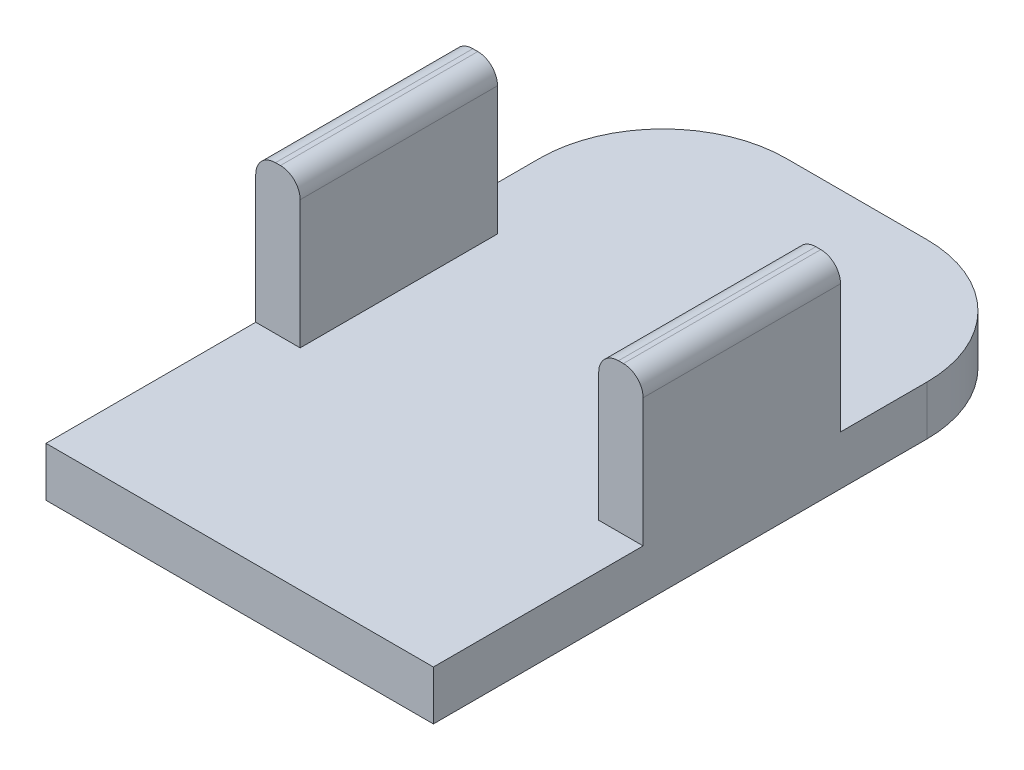
ISO-10303-21;
HEADER;
FILE_DESCRIPTION(('STEP AP214'),'2;1');
FILE_NAME('part.step','',(''),(''),'','','');
FILE_SCHEMA(('AUTOMOTIVE_DESIGN { 1 0 10303 214 1 1 1 1 }'));
ENDSEC;
DATA;
#1=APPLICATION_CONTEXT('core data for automotive mechanical design processes');
#2=APPLICATION_PROTOCOL_DEFINITION('international standard','automotive_design',2000,#1);
#3=PRODUCT_CONTEXT('',#1,'mechanical');
#4=PRODUCT('Part','Part','',(#3));
#5=PRODUCT_RELATED_PRODUCT_CATEGORY('part','',(#4));
#6=PRODUCT_DEFINITION_FORMATION('','',#4);
#7=PRODUCT_DEFINITION_CONTEXT('part definition',#1,'design');
#8=PRODUCT_DEFINITION('design','',#6,#7);
#9=PRODUCT_DEFINITION_SHAPE('','',#8);
#10=(LENGTH_UNIT() NAMED_UNIT(*) SI_UNIT(.MILLI.,.METRE.));
#11=(NAMED_UNIT(*) PLANE_ANGLE_UNIT() SI_UNIT($,.RADIAN.));
#12=(NAMED_UNIT(*) SI_UNIT($,.STERADIAN.) SOLID_ANGLE_UNIT());
#13=UNCERTAINTY_MEASURE_WITH_UNIT(LENGTH_MEASURE(1.E-05),#10,'distance_accuracy_value','');
#14=(GEOMETRIC_REPRESENTATION_CONTEXT(3) GLOBAL_UNCERTAINTY_ASSIGNED_CONTEXT((#13)) GLOBAL_UNIT_ASSIGNED_CONTEXT((#10,
#11,#12)) REPRESENTATION_CONTEXT('',''));
#15=CARTESIAN_POINT('',(0.,0.,0.));
#16=DIRECTION('',(0.,0.,1.));
#17=DIRECTION('',(1.,0.,0.));
#18=AXIS2_PLACEMENT_3D('',#15,#16,#17);
#19=CARTESIAN_POINT('',(7.23900000000001,0.,-19.05));
#20=DIRECTION('',(0.,1.,0.));
#21=DIRECTION('',(0.,0.,1.));
#22=AXIS2_PLACEMENT_3D('',#19,#20,#21);
#23=PLANE('',#22);
#24=DIRECTION('',(0.,0.,-1.));
#25=VECTOR('',#24,1.);
#26=CARTESIAN_POINT('',(-2.032,0.,-31.75));
#27=LINE('',#26,#25);
#28=CARTESIAN_POINT('',(-2.032,0.,-26.67));
#29=VERTEX_POINT('',#28);
#30=CARTESIAN_POINT('',(-2.032,0.,-31.75));
#31=VERTEX_POINT('',#30);
#32=EDGE_CURVE('E229',#29,#31,#27,.T.);
#33=ORIENTED_EDGE('',*,*,#32,.F.);
#34=DIRECTION('',(-1.,0.,0.));
#35=VECTOR('',#34,1.);
#36=CARTESIAN_POINT('',(-2.032,0.,-26.67));
#37=LINE('',#36,#35);
#38=CARTESIAN_POINT('',(0.,0.,-26.67));
#39=VERTEX_POINT('',#38);
#40=EDGE_CURVE('E213',#39,#29,#37,.T.);
#41=ORIENTED_EDGE('',*,*,#40,.F.);
#42=DIRECTION('',(0.,0.,1.));
#43=VECTOR('',#42,1.);
#44=CARTESIAN_POINT('',(0.,0.,-31.75));
#45=LINE('',#44,#43);
#46=CARTESIAN_POINT('',(0.,0.,-31.75));
#47=VERTEX_POINT('',#46);
#48=EDGE_CURVE('E225',#47,#39,#45,.T.);
#49=ORIENTED_EDGE('',*,*,#48,.F.);
#50=DIRECTION('',(1.,0.,0.));
#51=VECTOR('',#50,1.);
#52=CARTESIAN_POINT('',(-7.239,0.,-31.75));
#53=LINE('',#52,#51);
#54=CARTESIAN_POINT('',(7.23900000000001,0.,-31.75));
#55=VERTEX_POINT('',#54);
#56=EDGE_CURVE('E352',#47,#55,#53,.T.);
#57=ORIENTED_EDGE('',*,*,#56,.T.);
#58=CARTESIAN_POINT('',(7.23900000000001,0.,-19.05));
#59=DIRECTION('',(0.,1.,0.));
#60=DIRECTION('',(0.,0.,1.));
#61=AXIS2_PLACEMENT_3D('',#58,#59,#60);
#62=CIRCLE('',#61,12.7);
#63=CARTESIAN_POINT('',(19.939,0.,-19.05));
#64=VERTEX_POINT('',#63);
#65=EDGE_CURVE('E348',#64,#55,#62,.T.);
#66=ORIENTED_EDGE('',*,*,#65,.F.);
#67=DIRECTION('',(0.,0.,1.));
#68=VECTOR('',#67,1.);
#69=CARTESIAN_POINT('',(19.939,0.,-19.05));
#70=LINE('',#69,#68);
#71=CARTESIAN_POINT('',(19.939,0.,31.75));
#72=VERTEX_POINT('',#71);
#73=EDGE_CURVE('E344',#64,#72,#70,.T.);
#74=ORIENTED_EDGE('',*,*,#73,.T.);
#75=DIRECTION('',(1.,0.,0.));
#76=VECTOR('',#75,1.);
#77=CARTESIAN_POINT('',(-19.939,0.,31.75));
#78=LINE('',#77,#76);
#79=CARTESIAN_POINT('',(-19.939,0.,31.75));
#80=VERTEX_POINT('',#79);
#81=EDGE_CURVE('E314',#80,#72,#78,.T.);
#82=ORIENTED_EDGE('',*,*,#81,.F.);
#83=DIRECTION('',(0.,0.,1.));
#84=VECTOR('',#83,1.);
#85=CARTESIAN_POINT('',(-19.939,0.,-19.05));
#86=LINE('',#85,#84);
#87=CARTESIAN_POINT('',(-19.939,0.,-19.05));
#88=VERTEX_POINT('',#87);
#89=EDGE_CURVE('E320',#88,#80,#86,.T.);
#90=ORIENTED_EDGE('',*,*,#89,.F.);
#91=CARTESIAN_POINT('',(-7.23900000000001,0.,-19.05));
#92=DIRECTION('',(0.,1.,0.));
#93=DIRECTION('',(0.,0.,1.));
#94=AXIS2_PLACEMENT_3D('',#91,#92,#93);
#95=CIRCLE('',#94,12.7);
#96=CARTESIAN_POINT('',(-7.239,0.,-31.75));
#97=VERTEX_POINT('',#96);
#98=EDGE_CURVE('E356',#97,#88,#95,.T.);
#99=ORIENTED_EDGE('',*,*,#98,.F.);
#100=EDGE_CURVE('E353',#97,#31,#53,.T.);
#101=ORIENTED_EDGE('',*,*,#100,.T.);
#102=EDGE_LOOP('',(#33,#41,#49,#57,#66,#74,#82,#90,#99,#101));
#103=FACE_BOUND('',#102,.T.);
#104=ADVANCED_FACE('F47',(#103),#23,.F.);
#105=CARTESIAN_POINT('',(7.23900000000001,5.08,-19.05));
#106=DIRECTION('',(0.,1.,0.));
#107=DIRECTION('',(0.,0.,1.));
#108=AXIS2_PLACEMENT_3D('',#105,#106,#107);
#109=PLANE('',#108);
#110=DIRECTION('',(0.,0.,1.));
#111=VECTOR('',#110,1.);
#112=CARTESIAN_POINT('',(15.367,5.08,-10.16));
#113=LINE('',#112,#111);
#114=CARTESIAN_POINT('',(15.367,5.08,-10.16));
#115=VERTEX_POINT('',#114);
#116=CARTESIAN_POINT('',(15.367,5.08,10.16));
#117=VERTEX_POINT('',#116);
#118=EDGE_CURVE('E267',#115,#117,#113,.T.);
#119=ORIENTED_EDGE('',*,*,#118,.F.);
#120=DIRECTION('',(-1.,0.,0.));
#121=VECTOR('',#120,1.);
#122=CARTESIAN_POINT('',(19.939,5.08,-10.16));
#123=LINE('',#122,#121);
#124=CARTESIAN_POINT('',(19.939,5.08,-10.16));
#125=VERTEX_POINT('',#124);
#126=EDGE_CURVE('E272',#125,#115,#123,.T.);
#127=ORIENTED_EDGE('',*,*,#126,.F.);
#128=DIRECTION('',(0.,0.,1.));
#129=VECTOR('',#128,1.);
#130=CARTESIAN_POINT('',(19.939,5.08,-19.05));
#131=LINE('',#130,#129);
#132=CARTESIAN_POINT('',(19.939,5.08,-19.05));
#133=VERTEX_POINT('',#132);
#134=EDGE_CURVE('E321',#133,#125,#131,.T.);
#135=ORIENTED_EDGE('',*,*,#134,.F.);
#136=CARTESIAN_POINT('',(7.23900000000001,5.08,-19.05));
#137=DIRECTION('',(0.,1.,0.));
#138=DIRECTION('',(0.,0.,1.));
#139=AXIS2_PLACEMENT_3D('',#136,#137,#138);
#140=CIRCLE('',#139,12.7);
#141=CARTESIAN_POINT('',(7.23900000000001,5.08,-31.75));
#142=VERTEX_POINT('',#141);
#143=EDGE_CURVE('E325',#133,#142,#140,.T.);
#144=ORIENTED_EDGE('',*,*,#143,.T.);
#145=DIRECTION('',(1.,0.,0.));
#146=VECTOR('',#145,1.);
#147=CARTESIAN_POINT('',(-7.239,5.08,-31.75));
#148=LINE('',#147,#146);
#149=CARTESIAN_POINT('',(-7.239,5.08,-31.75));
#150=VERTEX_POINT('',#149);
#151=EDGE_CURVE('E328',#150,#142,#148,.T.);
#152=ORIENTED_EDGE('',*,*,#151,.F.);
#153=CARTESIAN_POINT('',(-7.23900000000001,5.08,-19.05));
#154=DIRECTION('',(0.,1.,0.));
#155=DIRECTION('',(0.,0.,1.));
#156=AXIS2_PLACEMENT_3D('',#153,#154,#155);
#157=CIRCLE('',#156,12.7);
#158=CARTESIAN_POINT('',(-19.939,5.08,-19.05));
#159=VERTEX_POINT('',#158);
#160=EDGE_CURVE('E332',#150,#159,#157,.T.);
#161=ORIENTED_EDGE('',*,*,#160,.T.);
#162=DIRECTION('',(0.,0.,1.));
#163=VECTOR('',#162,1.);
#164=CARTESIAN_POINT('',(-19.939,5.08,-19.05));
#165=LINE('',#164,#163);
#166=CARTESIAN_POINT('',(-19.939,5.08,-10.16));
#167=VERTEX_POINT('',#166);
#168=EDGE_CURVE('E336',#159,#167,#165,.T.);
#169=ORIENTED_EDGE('',*,*,#168,.T.);
#170=DIRECTION('',(-1.,0.,0.));
#171=VECTOR('',#170,1.);
#172=CARTESIAN_POINT('',(-19.939,5.08,-10.16));
#173=LINE('',#172,#171);
#174=CARTESIAN_POINT('',(-15.367,5.08,-10.16));
#175=VERTEX_POINT('',#174);
#176=EDGE_CURVE('E288',#175,#167,#173,.T.);
#177=ORIENTED_EDGE('',*,*,#176,.F.);
#178=DIRECTION('',(0.,0.,-1.));
#179=VECTOR('',#178,1.);
#180=CARTESIAN_POINT('',(-15.367,5.08,-10.16));
#181=LINE('',#180,#179);
#182=CARTESIAN_POINT('',(-15.367,5.08,10.16));
#183=VERTEX_POINT('',#182);
#184=EDGE_CURVE('E296',#183,#175,#181,.T.);
#185=ORIENTED_EDGE('',*,*,#184,.F.);
#186=DIRECTION('',(1.,0.,0.));
#187=VECTOR('',#186,1.);
#188=CARTESIAN_POINT('',(-19.939,5.08,10.16));
#189=LINE('',#188,#187);
#190=CARTESIAN_POINT('',(-19.939,5.08,10.16));
#191=VERTEX_POINT('',#190);
#192=EDGE_CURVE('E276',#191,#183,#189,.T.);
#193=ORIENTED_EDGE('',*,*,#192,.F.);
#194=CARTESIAN_POINT('',(-19.939,5.08,31.75));
#195=VERTEX_POINT('',#194);
#196=EDGE_CURVE('E335',#191,#195,#165,.T.);
#197=ORIENTED_EDGE('',*,*,#196,.T.);
#198=DIRECTION('',(1.,0.,0.));
#199=VECTOR('',#198,1.);
#200=CARTESIAN_POINT('',(-19.939,5.08,31.75));
#201=LINE('',#200,#199);
#202=CARTESIAN_POINT('',(19.939,5.08,31.75));
#203=VERTEX_POINT('',#202);
#204=EDGE_CURVE('E315',#195,#203,#201,.T.);
#205=ORIENTED_EDGE('',*,*,#204,.T.);
#206=CARTESIAN_POINT('',(19.939,5.08,10.16));
#207=VERTEX_POINT('',#206);
#208=EDGE_CURVE('E319',#207,#203,#131,.T.);
#209=ORIENTED_EDGE('',*,*,#208,.F.);
#210=DIRECTION('',(1.,0.,0.));
#211=VECTOR('',#210,1.);
#212=CARTESIAN_POINT('',(19.939,5.08,10.16));
#213=LINE('',#212,#211);
#214=EDGE_CURVE('E263',#117,#207,#213,.T.);
#215=ORIENTED_EDGE('',*,*,#214,.F.);
#216=EDGE_LOOP('',(#119,#127,#135,#144,#152,#161,#169,#177,#185,#193,#197,#205,#209,#215));
#217=FACE_BOUND('',#216,.T.);
#218=ADVANCED_FACE('F491',(#217),#109,.T.);
#219=CARTESIAN_POINT('',(-19.939,5.08,31.75));
#220=DIRECTION('',(0.,0.,-1.));
#221=DIRECTION('',(-1.,0.,0.));
#222=AXIS2_PLACEMENT_3D('',#219,#220,#221);
#223=PLANE('',#222);
#224=ORIENTED_EDGE('',*,*,#81,.T.);
#225=DIRECTION('',(0.,-1.,0.));
#226=VECTOR('',#225,1.);
#227=CARTESIAN_POINT('',(19.939,5.08,31.75));
#228=LINE('',#227,#226);
#229=EDGE_CURVE('E378',#203,#72,#228,.T.);
#230=ORIENTED_EDGE('',*,*,#229,.F.);
#231=ORIENTED_EDGE('',*,*,#204,.F.);
#232=DIRECTION('',(0.,-1.,0.));
#233=VECTOR('',#232,1.);
#234=CARTESIAN_POINT('',(-19.939,5.08,31.75));
#235=LINE('',#234,#233);
#236=EDGE_CURVE('E340',#195,#80,#235,.T.);
#237=ORIENTED_EDGE('',*,*,#236,.T.);
#238=EDGE_LOOP('',(#224,#230,#231,#237));
#239=FACE_BOUND('',#238,.T.);
#240=ADVANCED_FACE('F496',(#239),#223,.F.);
#241=CARTESIAN_POINT('',(19.939,5.08,-19.05));
#242=DIRECTION('',(1.,0.,0.));
#243=DIRECTION('',(0.,0.,-1.));
#244=AXIS2_PLACEMENT_3D('',#241,#242,#243);
#245=PLANE('',#244);
#246=DIRECTION('',(0.,-1.,0.));
#247=VECTOR('',#246,1.);
#248=CARTESIAN_POINT('',(19.939,20.32,-10.16));
#249=LINE('',#248,#247);
#250=CARTESIAN_POINT('',(19.939,18.288,-10.16));
#251=VERTEX_POINT('',#250);
#252=EDGE_CURVE('E250',#251,#125,#249,.T.);
#253=ORIENTED_EDGE('',*,*,#252,.F.);
#254=DIRECTION('',(0.,0.,-1.));
#255=VECTOR('',#254,1.);
#256=CARTESIAN_POINT('',(19.939,18.288,10.16));
#257=LINE('',#256,#255);
#258=CARTESIAN_POINT('',(19.939,18.288,10.16));
#259=VERTEX_POINT('',#258);
#260=EDGE_CURVE('E395',#251,#259,#257,.F.);
#261=ORIENTED_EDGE('',*,*,#260,.T.);
#262=DIRECTION('',(0.,-1.,0.));
#263=VECTOR('',#262,1.);
#264=CARTESIAN_POINT('',(19.939,20.32,10.16));
#265=LINE('',#264,#263);
#266=EDGE_CURVE('E259',#259,#207,#265,.T.);
#267=ORIENTED_EDGE('',*,*,#266,.T.);
#268=ORIENTED_EDGE('',*,*,#208,.T.);
#269=ORIENTED_EDGE('',*,*,#229,.T.);
#270=ORIENTED_EDGE('',*,*,#73,.F.);
#271=DIRECTION('',(0.,-1.,0.));
#272=VECTOR('',#271,1.);
#273=CARTESIAN_POINT('',(19.939,5.08,-19.05));
#274=LINE('',#273,#272);
#275=EDGE_CURVE('E375',#133,#64,#274,.T.);
#276=ORIENTED_EDGE('',*,*,#275,.F.);
#277=ORIENTED_EDGE('',*,*,#134,.T.);
#278=EDGE_LOOP('',(#253,#261,#267,#268,#269,#270,#276,#277));
#279=FACE_BOUND('',#278,.T.);
#280=ADVANCED_FACE('F515',(#279),#245,.T.);
#281=CARTESIAN_POINT('',(7.23900000000001,5.08,-19.05));
#282=DIRECTION('',(0.,-1.,0.));
#283=DIRECTION('',(0.,0.,-1.));
#284=AXIS2_PLACEMENT_3D('',#281,#282,#283);
#285=CYLINDRICAL_SURFACE('',#284,12.7);
#286=ORIENTED_EDGE('',*,*,#65,.T.);
#287=DIRECTION('',(0.,-1.,0.));
#288=VECTOR('',#287,1.);
#289=CARTESIAN_POINT('',(7.23900000000001,5.08,-31.75));
#290=LINE('',#289,#288);
#291=EDGE_CURVE('E371',#142,#55,#290,.T.);
#292=ORIENTED_EDGE('',*,*,#291,.F.);
#293=ORIENTED_EDGE('',*,*,#143,.F.);
#294=ORIENTED_EDGE('',*,*,#275,.T.);
#295=EDGE_LOOP('',(#286,#292,#293,#294));
#296=FACE_BOUND('',#295,.T.);
#297=ADVANCED_FACE('F512',(#296),#285,.T.);
#298=CARTESIAN_POINT('',(-7.239,5.08,-31.75));
#299=DIRECTION('',(0.,0.,-1.));
#300=DIRECTION('',(-1.,0.,0.));
#301=AXIS2_PLACEMENT_3D('',#298,#299,#300);
#302=PLANE('',#301);
#303=DIRECTION('',(0.,1.,0.));
#304=VECTOR('',#303,1.);
#305=CARTESIAN_POINT('',(0.,-12.7,-31.75));
#306=LINE('',#305,#304);
#307=CARTESIAN_POINT('',(0.,-7.61999999999992,-31.75));
#308=VERTEX_POINT('',#307);
#309=EDGE_CURVE('E219',#308,#47,#306,.T.);
#310=ORIENTED_EDGE('',*,*,#309,.F.);
#311=DIRECTION('',(-1.,0.,0.));
#312=VECTOR('',#311,1.);
#313=CARTESIAN_POINT('',(-2.032,-7.61999999999992,-31.75));
#314=LINE('',#313,#312);
#315=CARTESIAN_POINT('',(-2.032,-7.61999999999992,-31.75));
#316=VERTEX_POINT('',#315);
#317=EDGE_CURVE('E72',#308,#316,#314,.T.);
#318=ORIENTED_EDGE('',*,*,#317,.T.);
#319=DIRECTION('',(0.,1.,0.));
#320=VECTOR('',#319,1.);
#321=CARTESIAN_POINT('',(-2.032,-12.7,-31.75));
#322=LINE('',#321,#320);
#323=EDGE_CURVE('E247',#316,#31,#322,.T.);
#324=ORIENTED_EDGE('',*,*,#323,.T.);
#325=ORIENTED_EDGE('',*,*,#100,.F.);
#326=DIRECTION('',(0.,-1.,0.));
#327=VECTOR('',#326,1.);
#328=CARTESIAN_POINT('',(-7.239,5.08,-31.75));
#329=LINE('',#328,#327);
#330=EDGE_CURVE('E368',#150,#97,#329,.T.);
#331=ORIENTED_EDGE('',*,*,#330,.F.);
#332=ORIENTED_EDGE('',*,*,#151,.T.);
#333=ORIENTED_EDGE('',*,*,#291,.T.);
#334=ORIENTED_EDGE('',*,*,#56,.F.);
#335=EDGE_LOOP('',(#310,#318,#324,#325,#331,#332,#333,#334));
#336=FACE_BOUND('',#335,.T.);
#337=ADVANCED_FACE('F463',(#336),#302,.T.);
#338=CARTESIAN_POINT('',(-7.23900000000001,5.08,-19.05));
#339=DIRECTION('',(0.,-1.,0.));
#340=DIRECTION('',(0.,0.,-1.));
#341=AXIS2_PLACEMENT_3D('',#338,#339,#340);
#342=CYLINDRICAL_SURFACE('',#341,12.7);
#343=ORIENTED_EDGE('',*,*,#98,.T.);
#344=DIRECTION('',(0.,-1.,0.));
#345=VECTOR('',#344,1.);
#346=CARTESIAN_POINT('',(-19.939,5.08,-19.05));
#347=LINE('',#346,#345);
#348=EDGE_CURVE('E364',#159,#88,#347,.T.);
#349=ORIENTED_EDGE('',*,*,#348,.F.);
#350=ORIENTED_EDGE('',*,*,#160,.F.);
#351=ORIENTED_EDGE('',*,*,#330,.T.);
#352=EDGE_LOOP('',(#343,#349,#350,#351));
#353=FACE_BOUND('',#352,.T.);
#354=ADVANCED_FACE('F505',(#353),#342,.T.);
#355=CARTESIAN_POINT('',(-19.939,5.08,-19.05));
#356=DIRECTION('',(1.,0.,0.));
#357=DIRECTION('',(0.,0.,-1.));
#358=AXIS2_PLACEMENT_3D('',#355,#356,#357);
#359=PLANE('',#358);
#360=DIRECTION('',(0.,-1.,0.));
#361=VECTOR('',#360,1.);
#362=CARTESIAN_POINT('',(-19.939,20.32,10.16));
#363=LINE('',#362,#361);
#364=CARTESIAN_POINT('',(-19.939,18.288,10.16));
#365=VERTEX_POINT('',#364);
#366=EDGE_CURVE('E311',#365,#191,#363,.T.);
#367=ORIENTED_EDGE('',*,*,#366,.F.);
#368=DIRECTION('',(0.,0.,1.));
#369=VECTOR('',#368,1.);
#370=CARTESIAN_POINT('',(-19.939,18.288,-10.16));
#371=LINE('',#370,#369);
#372=CARTESIAN_POINT('',(-19.939,18.288,-10.16));
#373=VERTEX_POINT('',#372);
#374=EDGE_CURVE('E418',#365,#373,#371,.F.);
#375=ORIENTED_EDGE('',*,*,#374,.T.);
#376=DIRECTION('',(0.,-1.,0.));
#377=VECTOR('',#376,1.);
#378=CARTESIAN_POINT('',(-19.939,20.32,-10.16));
#379=LINE('',#378,#377);
#380=EDGE_CURVE('E292',#373,#167,#379,.T.);
#381=ORIENTED_EDGE('',*,*,#380,.T.);
#382=ORIENTED_EDGE('',*,*,#168,.F.);
#383=ORIENTED_EDGE('',*,*,#348,.T.);
#384=ORIENTED_EDGE('',*,*,#89,.T.);
#385=ORIENTED_EDGE('',*,*,#236,.F.);
#386=ORIENTED_EDGE('',*,*,#196,.F.);
#387=EDGE_LOOP('',(#367,#375,#381,#382,#383,#384,#385,#386));
#388=FACE_BOUND('',#387,.T.);
#389=ADVANCED_FACE('F501',(#388),#359,.F.);
#390=CARTESIAN_POINT('',(-19.939,20.32,10.16));
#391=DIRECTION('',(0.,0.,-1.));
#392=DIRECTION('',(-1.,0.,0.));
#393=AXIS2_PLACEMENT_3D('',#390,#391,#392);
#394=PLANE('',#393);
#395=DIRECTION('',(1.,0.,0.));
#396=VECTOR('',#395,1.);
#397=CARTESIAN_POINT('',(-19.939,20.32,10.16));
#398=LINE('',#397,#396);
#399=CARTESIAN_POINT('',(-17.907,20.32,10.16));
#400=VERTEX_POINT('',#399);
#401=CARTESIAN_POINT('',(-17.399,20.32,10.16));
#402=VERTEX_POINT('',#401);
#403=EDGE_CURVE('E283',#400,#402,#398,.T.);
#404=ORIENTED_EDGE('',*,*,#403,.F.);
#405=CARTESIAN_POINT('',(-17.907,18.288,10.16));
#406=DIRECTION('',(0.,0.,-1.));
#407=DIRECTION('',(-1.,0.,0.));
#408=AXIS2_PLACEMENT_3D('',#405,#406,#407);
#409=CIRCLE('',#408,2.032);
#410=EDGE_CURVE('E415',#400,#365,#409,.F.);
#411=ORIENTED_EDGE('',*,*,#410,.T.);
#412=ORIENTED_EDGE('',*,*,#366,.T.);
#413=ORIENTED_EDGE('',*,*,#192,.T.);
#414=DIRECTION('',(0.,-1.,0.));
#415=VECTOR('',#414,1.);
#416=CARTESIAN_POINT('',(-15.367,20.32,10.16));
#417=LINE('',#416,#415);
#418=CARTESIAN_POINT('',(-15.367,18.288,10.16));
#419=VERTEX_POINT('',#418);
#420=EDGE_CURVE('E308',#419,#183,#417,.T.);
#421=ORIENTED_EDGE('',*,*,#420,.F.);
#422=CARTESIAN_POINT('',(-17.399,18.288,10.16));
#423=DIRECTION('',(0.,0.,-1.));
#424=DIRECTION('',(-1.,0.,0.));
#425=AXIS2_PLACEMENT_3D('',#422,#423,#424);
#426=CIRCLE('',#425,2.032);
#427=EDGE_CURVE('E412',#419,#402,#426,.F.);
#428=ORIENTED_EDGE('',*,*,#427,.T.);
#429=EDGE_LOOP('',(#404,#411,#412,#413,#421,#428));
#430=FACE_BOUND('',#429,.T.);
#431=ADVANCED_FACE('F504',(#430),#394,.F.);
#432=CARTESIAN_POINT('',(-15.367,20.32,-10.16));
#433=DIRECTION('',(-1.,0.,0.));
#434=DIRECTION('',(0.,0.,1.));
#435=AXIS2_PLACEMENT_3D('',#432,#433,#434);
#436=PLANE('',#435);
#437=DIRECTION('',(0.,-1.,0.));
#438=VECTOR('',#437,1.);
#439=CARTESIAN_POINT('',(-15.367,20.32,-10.16));
#440=LINE('',#439,#438);
#441=CARTESIAN_POINT('',(-15.367,18.288,-10.16));
#442=VERTEX_POINT('',#441);
#443=EDGE_CURVE('E305',#442,#175,#440,.T.);
#444=ORIENTED_EDGE('',*,*,#443,.F.);
#445=DIRECTION('',(0.,0.,-1.));
#446=VECTOR('',#445,1.);
#447=CARTESIAN_POINT('',(-15.367,18.288,10.16));
#448=LINE('',#447,#446);
#449=EDGE_CURVE('E430',#442,#419,#448,.F.);
#450=ORIENTED_EDGE('',*,*,#449,.T.);
#451=ORIENTED_EDGE('',*,*,#420,.T.);
#452=ORIENTED_EDGE('',*,*,#184,.T.);
#453=EDGE_LOOP('',(#444,#450,#451,#452));
#454=FACE_BOUND('',#453,.T.);
#455=ADVANCED_FACE('F653',(#454),#436,.F.);
#456=CARTESIAN_POINT('',(-19.939,20.32,-10.16));
#457=DIRECTION('',(0.,0.,1.));
#458=DIRECTION('',(1.,0.,0.));
#459=AXIS2_PLACEMENT_3D('',#456,#457,#458);
#460=PLANE('',#459);
#461=ORIENTED_EDGE('',*,*,#380,.F.);
#462=CARTESIAN_POINT('',(-17.907,18.288,-10.16));
#463=DIRECTION('',(0.,0.,1.));
#464=DIRECTION('',(1.,0.,0.));
#465=AXIS2_PLACEMENT_3D('',#462,#463,#464);
#466=CIRCLE('',#465,2.032);
#467=CARTESIAN_POINT('',(-17.907,20.32,-10.16));
#468=VERTEX_POINT('',#467);
#469=EDGE_CURVE('E424',#373,#468,#466,.F.);
#470=ORIENTED_EDGE('',*,*,#469,.T.);
#471=DIRECTION('',(-1.,0.,0.));
#472=VECTOR('',#471,1.);
#473=CARTESIAN_POINT('',(-19.939,20.32,-10.16));
#474=LINE('',#473,#472);
#475=CARTESIAN_POINT('',(-17.399,20.32,-10.16));
#476=VERTEX_POINT('',#475);
#477=EDGE_CURVE('E287',#476,#468,#474,.T.);
#478=ORIENTED_EDGE('',*,*,#477,.F.);
#479=CARTESIAN_POINT('',(-17.399,18.288,-10.16));
#480=DIRECTION('',(0.,0.,1.));
#481=DIRECTION('',(1.,0.,0.));
#482=AXIS2_PLACEMENT_3D('',#479,#480,#481);
#483=CIRCLE('',#482,2.032);
#484=EDGE_CURVE('E421',#476,#442,#483,.F.);
#485=ORIENTED_EDGE('',*,*,#484,.T.);
#486=ORIENTED_EDGE('',*,*,#443,.T.);
#487=ORIENTED_EDGE('',*,*,#176,.T.);
#488=EDGE_LOOP('',(#461,#470,#478,#485,#486,#487));
#489=FACE_BOUND('',#488,.T.);
#490=ADVANCED_FACE('F643',(#489),#460,.F.);
#491=CARTESIAN_POINT('',(0.,20.32,0.));
#492=DIRECTION('',(0.,1.,0.));
#493=DIRECTION('',(0.,0.,1.));
#494=AXIS2_PLACEMENT_3D('',#491,#492,#493);
#495=PLANE('',#494);
#496=ORIENTED_EDGE('',*,*,#477,.T.);
#497=DIRECTION('',(0.,0.,1.));
#498=VECTOR('',#497,1.);
#499=CARTESIAN_POINT('',(-17.907,20.32,10.16));
#500=LINE('',#499,#498);
#501=EDGE_CURVE('E408',#468,#400,#500,.T.);
#502=ORIENTED_EDGE('',*,*,#501,.T.);
#503=ORIENTED_EDGE('',*,*,#403,.T.);
#504=DIRECTION('',(0.,0.,-1.));
#505=VECTOR('',#504,1.);
#506=CARTESIAN_POINT('',(-17.399,20.32,-10.16));
#507=LINE('',#506,#505);
#508=EDGE_CURVE('E404',#402,#476,#507,.T.);
#509=ORIENTED_EDGE('',*,*,#508,.T.);
#510=EDGE_LOOP('',(#496,#502,#503,#509));
#511=FACE_BOUND('',#510,.T.);
#512=ADVANCED_FACE('F633',(#511),#495,.T.);
#513=CARTESIAN_POINT('',(19.939,20.32,-10.16));
#514=DIRECTION('',(0.,0.,1.));
#515=DIRECTION('',(1.,0.,0.));
#516=AXIS2_PLACEMENT_3D('',#513,#514,#515);
#517=PLANE('',#516);
#518=DIRECTION('',(-1.,0.,0.));
#519=VECTOR('',#518,1.);
#520=CARTESIAN_POINT('',(19.939,20.32,-10.16));
#521=LINE('',#520,#519);
#522=CARTESIAN_POINT('',(17.907,20.32,-10.16));
#523=VERTEX_POINT('',#522);
#524=CARTESIAN_POINT('',(17.399,20.32,-10.16));
#525=VERTEX_POINT('',#524);
#526=EDGE_CURVE('E268',#523,#525,#521,.T.);
#527=ORIENTED_EDGE('',*,*,#526,.F.);
#528=CARTESIAN_POINT('',(17.907,18.288,-10.16));
#529=DIRECTION('',(0.,0.,1.));
#530=DIRECTION('',(1.,0.,0.));
#531=AXIS2_PLACEMENT_3D('',#528,#529,#530);
#532=CIRCLE('',#531,2.032);
#533=EDGE_CURVE('E392',#523,#251,#532,.F.);
#534=ORIENTED_EDGE('',*,*,#533,.T.);
#535=ORIENTED_EDGE('',*,*,#252,.T.);
#536=ORIENTED_EDGE('',*,*,#126,.T.);
#537=DIRECTION('',(0.,-1.,0.));
#538=VECTOR('',#537,1.);
#539=CARTESIAN_POINT('',(15.367,20.32,-10.16));
#540=LINE('',#539,#538);
#541=CARTESIAN_POINT('',(15.367,18.288,-10.16));
#542=VERTEX_POINT('',#541);
#543=EDGE_CURVE('E253',#542,#115,#540,.T.);
#544=ORIENTED_EDGE('',*,*,#543,.F.);
#545=CARTESIAN_POINT('',(17.399,18.288,-10.16));
#546=DIRECTION('',(0.,0.,1.));
#547=DIRECTION('',(1.,0.,0.));
#548=AXIS2_PLACEMENT_3D('',#545,#546,#547);
#549=CIRCLE('',#548,2.032);
#550=EDGE_CURVE('E389',#542,#525,#549,.F.);
#551=ORIENTED_EDGE('',*,*,#550,.T.);
#552=EDGE_LOOP('',(#527,#534,#535,#536,#544,#551));
#553=FACE_BOUND('',#552,.T.);
#554=ADVANCED_FACE('F623',(#553),#517,.F.);
#555=CARTESIAN_POINT('',(15.367,20.32,-10.16));
#556=DIRECTION('',(1.,0.,0.));
#557=DIRECTION('',(0.,0.,-1.));
#558=AXIS2_PLACEMENT_3D('',#555,#556,#557);
#559=PLANE('',#558);
#560=DIRECTION('',(0.,-1.,0.));
#561=VECTOR('',#560,1.);
#562=CARTESIAN_POINT('',(15.367,20.32,10.16));
#563=LINE('',#562,#561);
#564=CARTESIAN_POINT('',(15.367,18.288,10.16));
#565=VERTEX_POINT('',#564);
#566=EDGE_CURVE('E256',#565,#117,#563,.T.);
#567=ORIENTED_EDGE('',*,*,#566,.F.);
#568=DIRECTION('',(0.,0.,1.));
#569=VECTOR('',#568,1.);
#570=CARTESIAN_POINT('',(15.367,18.288,-10.16));
#571=LINE('',#570,#569);
#572=EDGE_CURVE('E427',#565,#542,#571,.F.);
#573=ORIENTED_EDGE('',*,*,#572,.T.);
#574=ORIENTED_EDGE('',*,*,#543,.T.);
#575=ORIENTED_EDGE('',*,*,#118,.T.);
#576=EDGE_LOOP('',(#567,#573,#574,#575));
#577=FACE_BOUND('',#576,.T.);
#578=ADVANCED_FACE('F613',(#577),#559,.F.);
#579=CARTESIAN_POINT('',(19.939,20.32,10.16));
#580=DIRECTION('',(0.,0.,-1.));
#581=DIRECTION('',(-1.,0.,0.));
#582=AXIS2_PLACEMENT_3D('',#579,#580,#581);
#583=PLANE('',#582);
#584=ORIENTED_EDGE('',*,*,#266,.F.);
#585=CARTESIAN_POINT('',(17.907,18.288,10.16));
#586=DIRECTION('',(0.,0.,-1.));
#587=DIRECTION('',(-1.,0.,0.));
#588=AXIS2_PLACEMENT_3D('',#585,#586,#587);
#589=CIRCLE('',#588,2.032);
#590=CARTESIAN_POINT('',(17.907,20.32,10.16));
#591=VERTEX_POINT('',#590);
#592=EDGE_CURVE('E401',#259,#591,#589,.F.);
#593=ORIENTED_EDGE('',*,*,#592,.T.);
#594=DIRECTION('',(1.,0.,0.));
#595=VECTOR('',#594,1.);
#596=CARTESIAN_POINT('',(19.939,20.32,10.16));
#597=LINE('',#596,#595);
#598=CARTESIAN_POINT('',(17.399,20.32,10.16));
#599=VERTEX_POINT('',#598);
#600=EDGE_CURVE('E262',#599,#591,#597,.T.);
#601=ORIENTED_EDGE('',*,*,#600,.F.);
#602=CARTESIAN_POINT('',(17.399,18.288,10.16));
#603=DIRECTION('',(0.,0.,-1.));
#604=DIRECTION('',(-1.,0.,0.));
#605=AXIS2_PLACEMENT_3D('',#602,#603,#604);
#606=CIRCLE('',#605,2.032);
#607=EDGE_CURVE('E398',#599,#565,#606,.F.);
#608=ORIENTED_EDGE('',*,*,#607,.T.);
#609=ORIENTED_EDGE('',*,*,#566,.T.);
#610=ORIENTED_EDGE('',*,*,#214,.T.);
#611=EDGE_LOOP('',(#584,#593,#601,#608,#609,#610));
#612=FACE_BOUND('',#611,.T.);
#613=ADVANCED_FACE('F603',(#612),#583,.F.);
#614=CARTESIAN_POINT('',(0.,20.32,0.));
#615=DIRECTION('',(0.,-1.,0.));
#616=DIRECTION('',(0.,0.,-1.));
#617=AXIS2_PLACEMENT_3D('',#614,#615,#616);
#618=PLANE('',#617);
#619=ORIENTED_EDGE('',*,*,#600,.T.);
#620=DIRECTION('',(0.,0.,-1.));
#621=VECTOR('',#620,1.);
#622=CARTESIAN_POINT('',(17.907,20.32,-10.16));
#623=LINE('',#622,#621);
#624=EDGE_CURVE('E385',#591,#523,#623,.T.);
#625=ORIENTED_EDGE('',*,*,#624,.T.);
#626=ORIENTED_EDGE('',*,*,#526,.T.);
#627=DIRECTION('',(0.,0.,1.));
#628=VECTOR('',#627,1.);
#629=CARTESIAN_POINT('',(17.399,20.32,0.));
#630=LINE('',#629,#628);
#631=EDGE_CURVE('E381',#525,#599,#630,.T.);
#632=ORIENTED_EDGE('',*,*,#631,.T.);
#633=EDGE_LOOP('',(#619,#625,#626,#632));
#634=FACE_BOUND('',#633,.T.);
#635=ADVANCED_FACE('F527',(#634),#618,.F.);
#636=CARTESIAN_POINT('',(17.907,18.288,0.));
#637=DIRECTION('',(0.,0.,1.));
#638=DIRECTION('',(1.,0.,0.));
#639=AXIS2_PLACEMENT_3D('',#636,#637,#638);
#640=CYLINDRICAL_SURFACE('',#639,2.032);
#641=ORIENTED_EDGE('',*,*,#592,.F.);
#642=ORIENTED_EDGE('',*,*,#260,.F.);
#643=ORIENTED_EDGE('',*,*,#533,.F.);
#644=ORIENTED_EDGE('',*,*,#624,.F.);
#645=EDGE_LOOP('',(#641,#642,#643,#644));
#646=FACE_BOUND('',#645,.T.);
#647=ADVANCED_FACE('F523',(#646),#640,.T.);
#648=CARTESIAN_POINT('',(-17.907,18.288,0.));
#649=DIRECTION('',(0.,0.,-1.));
#650=DIRECTION('',(-1.,0.,0.));
#651=AXIS2_PLACEMENT_3D('',#648,#649,#650);
#652=CYLINDRICAL_SURFACE('',#651,2.032);
#653=ORIENTED_EDGE('',*,*,#469,.F.);
#654=ORIENTED_EDGE('',*,*,#374,.F.);
#655=ORIENTED_EDGE('',*,*,#410,.F.);
#656=ORIENTED_EDGE('',*,*,#501,.F.);
#657=EDGE_LOOP('',(#653,#654,#655,#656));
#658=FACE_BOUND('',#657,.T.);
#659=ADVANCED_FACE('F526',(#658),#652,.T.);
#660=CARTESIAN_POINT('',(17.399,18.288,0.));
#661=DIRECTION('',(0.,0.,1.));
#662=DIRECTION('',(1.,0.,0.));
#663=AXIS2_PLACEMENT_3D('',#660,#661,#662);
#664=CYLINDRICAL_SURFACE('',#663,2.032);
#665=ORIENTED_EDGE('',*,*,#550,.F.);
#666=ORIENTED_EDGE('',*,*,#572,.F.);
#667=ORIENTED_EDGE('',*,*,#607,.F.);
#668=ORIENTED_EDGE('',*,*,#631,.F.);
#669=EDGE_LOOP('',(#665,#666,#667,#668));
#670=FACE_BOUND('',#669,.T.);
#671=ADVANCED_FACE('F531',(#670),#664,.T.);
#672=CARTESIAN_POINT('',(-17.399,18.288,0.));
#673=DIRECTION('',(0.,0.,1.));
#674=DIRECTION('',(1.,0.,0.));
#675=AXIS2_PLACEMENT_3D('',#672,#673,#674);
#676=CYLINDRICAL_SURFACE('',#675,2.032);
#677=ORIENTED_EDGE('',*,*,#427,.F.);
#678=ORIENTED_EDGE('',*,*,#449,.F.);
#679=ORIENTED_EDGE('',*,*,#484,.F.);
#680=ORIENTED_EDGE('',*,*,#508,.F.);
#681=EDGE_LOOP('',(#677,#678,#679,#680));
#682=FACE_BOUND('',#681,.T.);
#683=ADVANCED_FACE('F487',(#682),#676,.T.);
#684=CARTESIAN_POINT('',(-2.032,-12.7,-31.75));
#685=DIRECTION('',(1.,0.,0.));
#686=DIRECTION('',(0.,0.,-1.));
#687=AXIS2_PLACEMENT_3D('',#684,#685,#686);
#688=PLANE('',#687);
#689=CARTESIAN_POINT('',(-2.032,-7.62,-29.21));
#690=DIRECTION('',(1.,0.,0.));
#691=DIRECTION('',(0.,0.,-1.));
#692=AXIS2_PLACEMENT_3D('',#689,#690,#691);
#693=CIRCLE('',#692,0.889000000000003);
#694=CARTESIAN_POINT('',(-2.032,-7.62,-30.099));
#695=VERTEX_POINT('',#694);
#696=EDGE_CURVE('E238',#695,#695,#693,.T.);
#697=ORIENTED_EDGE('',*,*,#696,.T.);
#698=EDGE_LOOP('',(#697));
#699=FACE_BOUND('',#698,.T.);
#700=ORIENTED_EDGE('',*,*,#323,.F.);
#701=DIRECTION('',(0.,-0.93969262078591,0.342020143325666));
#702=VECTOR('',#701,1.);
#703=CARTESIAN_POINT('',(-2.032,-12.7,-29.9010312099277));
#704=LINE('',#703,#702);
#705=CARTESIAN_POINT('',(-2.032,-12.7,-29.9010312099277));
#706=VERTEX_POINT('',#705);
#707=EDGE_CURVE('E57',#316,#706,#704,.T.);
#708=ORIENTED_EDGE('',*,*,#707,.T.);
#709=DIRECTION('',(0.,0.,-1.));
#710=VECTOR('',#709,1.);
#711=CARTESIAN_POINT('',(-2.032,-12.7,-31.75));
#712=LINE('',#711,#710);
#713=CARTESIAN_POINT('',(-2.032,-12.7,-28.5189687900723));
#714=VERTEX_POINT('',#713);
#715=EDGE_CURVE('E231',#714,#706,#712,.T.);
#716=ORIENTED_EDGE('',*,*,#715,.F.);
#717=DIRECTION('',(0.,-0.93969262078591,-0.342020143325666));
#718=VECTOR('',#717,1.);
#719=CARTESIAN_POINT('',(-2.032,-12.7,-28.5189687900723));
#720=LINE('',#719,#718);
#721=CARTESIAN_POINT('',(-2.032,-7.61999999999996,-26.67));
#722=VERTEX_POINT('',#721);
#723=EDGE_CURVE('E64',#714,#722,#720,.F.);
#724=ORIENTED_EDGE('',*,*,#723,.T.);
#725=DIRECTION('',(0.,1.,0.));
#726=VECTOR('',#725,1.);
#727=CARTESIAN_POINT('',(-2.032,-12.7,-26.67));
#728=LINE('',#727,#726);
#729=EDGE_CURVE('E220',#722,#29,#728,.T.);
#730=ORIENTED_EDGE('',*,*,#729,.T.);
#731=ORIENTED_EDGE('',*,*,#32,.T.);
#732=EDGE_LOOP('',(#700,#708,#716,#724,#730,#731));
#733=FACE_BOUND('',#732,.T.);
#734=ADVANCED_FACE('F453',(#699,#733),#688,.F.);
#735=CARTESIAN_POINT('',(0.,-12.7,-31.75));
#736=DIRECTION('',(-1.,0.,0.));
#737=DIRECTION('',(0.,0.,1.));
#738=AXIS2_PLACEMENT_3D('',#735,#736,#737);
#739=PLANE('',#738);
#740=CARTESIAN_POINT('',(0.,-7.62,-29.21));
#741=DIRECTION('',(1.,0.,0.));
#742=DIRECTION('',(0.,0.,-1.));
#743=AXIS2_PLACEMENT_3D('',#740,#741,#742);
#744=CIRCLE('',#743,0.889000000000003);
#745=CARTESIAN_POINT('',(0.,-7.62,-30.099));
#746=VERTEX_POINT('',#745);
#747=EDGE_CURVE('E472',#746,#746,#744,.T.);
#748=ORIENTED_EDGE('',*,*,#747,.F.);
#749=EDGE_LOOP('',(#748));
#750=FACE_BOUND('',#749,.T.);
#751=DIRECTION('',(0.,0.,1.));
#752=VECTOR('',#751,1.);
#753=CARTESIAN_POINT('',(0.,-12.7,-31.75));
#754=LINE('',#753,#752);
#755=CARTESIAN_POINT('',(0.,-12.7,-29.9010312099277));
#756=VERTEX_POINT('',#755);
#757=CARTESIAN_POINT('',(0.,-12.7,-28.5189687900723));
#758=VERTEX_POINT('',#757);
#759=EDGE_CURVE('E243',#756,#758,#754,.T.);
#760=ORIENTED_EDGE('',*,*,#759,.F.);
#761=DIRECTION('',(0.,0.93969262078591,-0.342020143325666));
#762=VECTOR('',#761,1.);
#763=CARTESIAN_POINT('',(0.,-12.7,-29.9010312099277));
#764=LINE('',#763,#762);
#765=EDGE_CURVE('E444',#756,#308,#764,.T.);
#766=ORIENTED_EDGE('',*,*,#765,.T.);
#767=ORIENTED_EDGE('',*,*,#309,.T.);
#768=ORIENTED_EDGE('',*,*,#48,.T.);
#769=DIRECTION('',(0.,1.,0.));
#770=VECTOR('',#769,1.);
#771=CARTESIAN_POINT('',(0.,-12.7,-26.67));
#772=LINE('',#771,#770);
#773=CARTESIAN_POINT('',(0.,-7.61999999999996,-26.67));
#774=VERTEX_POINT('',#773);
#775=EDGE_CURVE('E210',#774,#39,#772,.T.);
#776=ORIENTED_EDGE('',*,*,#775,.F.);
#777=DIRECTION('',(0.,0.93969262078591,0.342020143325666));
#778=VECTOR('',#777,1.);
#779=CARTESIAN_POINT('',(0.,-12.7,-28.5189687900723));
#780=LINE('',#779,#778);
#781=EDGE_CURVE('E441',#774,#758,#780,.F.);
#782=ORIENTED_EDGE('',*,*,#781,.T.);
#783=EDGE_LOOP('',(#760,#766,#767,#768,#776,#782));
#784=FACE_BOUND('',#783,.T.);
#785=ADVANCED_FACE('F234',(#750,#784),#739,.F.);
#786=CARTESIAN_POINT('',(-2.032,-12.7,-26.67));
#787=DIRECTION('',(0.,0.,-1.));
#788=DIRECTION('',(-1.,0.,0.));
#789=AXIS2_PLACEMENT_3D('',#786,#787,#788);
#790=PLANE('',#789);
#791=ORIENTED_EDGE('',*,*,#729,.F.);
#792=DIRECTION('',(1.,0.,0.));
#793=VECTOR('',#792,1.);
#794=CARTESIAN_POINT('',(-2.032,-7.61999999999996,-26.67));
#795=LINE('',#794,#793);
#796=EDGE_CURVE('E11',#722,#774,#795,.T.);
#797=ORIENTED_EDGE('',*,*,#796,.T.);
#798=ORIENTED_EDGE('',*,*,#775,.T.);
#799=ORIENTED_EDGE('',*,*,#40,.T.);
#800=EDGE_LOOP('',(#791,#797,#798,#799));
#801=FACE_BOUND('',#800,.T.);
#802=ADVANCED_FACE('F212',(#801),#790,.F.);
#803=CARTESIAN_POINT('',(0.,-12.7,0.));
#804=DIRECTION('',(0.,1.,0.));
#805=DIRECTION('',(0.,0.,1.));
#806=AXIS2_PLACEMENT_3D('',#803,#804,#805);
#807=PLANE('',#806);
#808=ORIENTED_EDGE('',*,*,#715,.T.);
#809=DIRECTION('',(1.,0.,0.));
#810=VECTOR('',#809,1.);
#811=CARTESIAN_POINT('',(0.,-12.7,-29.9010312099277));
#812=LINE('',#811,#810);
#813=EDGE_CURVE('E437',#706,#756,#812,.T.);
#814=ORIENTED_EDGE('',*,*,#813,.T.);
#815=ORIENTED_EDGE('',*,*,#759,.T.);
#816=DIRECTION('',(-1.,0.,0.));
#817=VECTOR('',#816,1.);
#818=CARTESIAN_POINT('',(0.,-12.7,-28.5189687900723));
#819=LINE('',#818,#817);
#820=EDGE_CURVE('E433',#758,#714,#819,.T.);
#821=ORIENTED_EDGE('',*,*,#820,.T.);
#822=EDGE_LOOP('',(#808,#814,#815,#821));
#823=FACE_BOUND('',#822,.T.);
#824=ADVANCED_FACE('F457',(#823),#807,.F.);
#825=CARTESIAN_POINT('',(-12.7,-7.62,-29.21));
#826=DIRECTION('',(1.,0.,0.));
#827=DIRECTION('',(0.,0.,-1.));
#828=AXIS2_PLACEMENT_3D('',#825,#826,#827);
#829=CYLINDRICAL_SURFACE('',#828,0.889000000000003);
#830=ORIENTED_EDGE('',*,*,#747,.T.);
#831=EDGE_LOOP('',(#830));
#832=FACE_BOUND('',#831,.T.);
#833=ORIENTED_EDGE('',*,*,#696,.F.);
#834=EDGE_LOOP('',(#833));
#835=FACE_BOUND('',#834,.T.);
#836=ADVANCED_FACE('F477',(#832,#835),#829,.F.);
#837=CARTESIAN_POINT('',(0.,-12.7,-29.9010312099277));
#838=DIRECTION('',(0.,-0.342020143325666,-0.939692620785909));
#839=DIRECTION('',(-1.,0.,0.));
#840=AXIS2_PLACEMENT_3D('',#837,#838,#839);
#841=PLANE('',#840);
#842=ORIENTED_EDGE('',*,*,#707,.F.);
#843=ORIENTED_EDGE('',*,*,#317,.F.);
#844=ORIENTED_EDGE('',*,*,#765,.F.);
#845=ORIENTED_EDGE('',*,*,#813,.F.);
#846=EDGE_LOOP('',(#842,#843,#844,#845));
#847=FACE_BOUND('',#846,.T.);
#848=ADVANCED_FACE('F462',(#847),#841,.T.);
#849=CARTESIAN_POINT('',(0.,-12.7,-28.5189687900723));
#850=DIRECTION('',(0.,0.342020143325666,-0.93969262078591));
#851=DIRECTION('',(-1.,0.,0.));
#852=AXIS2_PLACEMENT_3D('',#849,#850,#851);
#853=PLANE('',#852);
#854=ORIENTED_EDGE('',*,*,#781,.F.);
#855=ORIENTED_EDGE('',*,*,#796,.F.);
#856=ORIENTED_EDGE('',*,*,#723,.F.);
#857=ORIENTED_EDGE('',*,*,#820,.F.);
#858=EDGE_LOOP('',(#854,#855,#856,#857));
#859=FACE_BOUND('',#858,.T.);
#860=ADVANCED_FACE('F50',(#859),#853,.F.);
#861=CLOSED_SHELL('',(#104,#218,#240,#280,#297,#337,#354,#389,#431,#455,#490,#512,#554,#578,
#613,#635,#647,#659,#671,#683,#734,#785,#802,#824,#836,#848,#860));
#862=MANIFOLD_SOLID_BREP('B2',#861);
#863=ADVANCED_BREP_SHAPE_REPRESENTATION('',(#18,#862),#14);
#864=SHAPE_DEFINITION_REPRESENTATION(#9,#863);
ENDSEC;
END-ISO-10303-21;
